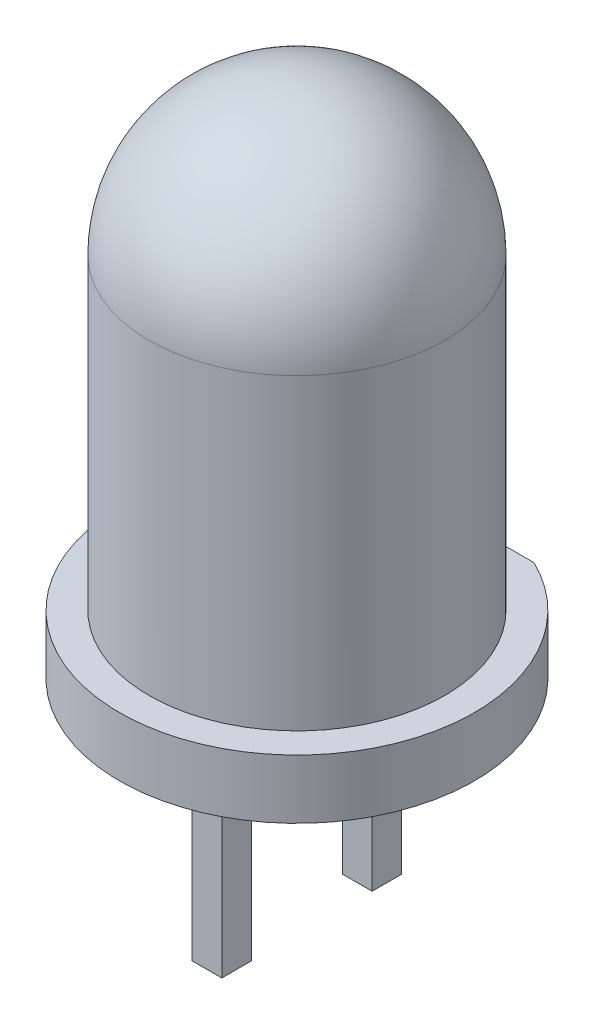
ISO-10303-21;
HEADER;
FILE_DESCRIPTION(('STEP AP214'),'2;1');
FILE_NAME('part.step','',(''),(''),'','','');
FILE_SCHEMA(('AUTOMOTIVE_DESIGN { 1 0 10303 214 1 1 1 1 }'));
ENDSEC;
DATA;
#1=APPLICATION_CONTEXT('core data for automotive mechanical design processes');
#2=APPLICATION_PROTOCOL_DEFINITION('international standard','automotive_design',2000,#1);
#3=PRODUCT_CONTEXT('',#1,'mechanical');
#4=PRODUCT('Part','Part','',(#3));
#5=PRODUCT_RELATED_PRODUCT_CATEGORY('part','',(#4));
#6=PRODUCT_DEFINITION_FORMATION('','',#4);
#7=PRODUCT_DEFINITION_CONTEXT('part definition',#1,'design');
#8=PRODUCT_DEFINITION('design','',#6,#7);
#9=PRODUCT_DEFINITION_SHAPE('','',#8);
#10=(LENGTH_UNIT() NAMED_UNIT(*) SI_UNIT(.MILLI.,.METRE.));
#11=(NAMED_UNIT(*) PLANE_ANGLE_UNIT() SI_UNIT($,.RADIAN.));
#12=(NAMED_UNIT(*) SI_UNIT($,.STERADIAN.) SOLID_ANGLE_UNIT());
#13=UNCERTAINTY_MEASURE_WITH_UNIT(LENGTH_MEASURE(1.E-05),#10,'distance_accuracy_value','');
#14=(GEOMETRIC_REPRESENTATION_CONTEXT(3) GLOBAL_UNCERTAINTY_ASSIGNED_CONTEXT((#13)) GLOBAL_UNIT_ASSIGNED_CONTEXT((#10,
#11,#12)) REPRESENTATION_CONTEXT('',''));
#15=CARTESIAN_POINT('',(0.,0.,0.));
#16=DIRECTION('',(0.,0.,1.));
#17=DIRECTION('',(1.,0.,0.));
#18=AXIS2_PLACEMENT_3D('',#15,#16,#17);
#19=CARTESIAN_POINT('',(4.40526328176769,2.95203620370635,9.18065991280056));
#20=DIRECTION('',(0.,1.,0.));
#21=DIRECTION('',(0.,0.,1.));
#22=AXIS2_PLACEMENT_3D('',#19,#20,#21);
#23=PLANE('',#22);
#24=CARTESIAN_POINT('',(4.40526328176769,2.95203620370635,9.18065991280056));
#25=DIRECTION('',(0.,-1.,0.));
#26=DIRECTION('',(0.,0.,-1.));
#27=AXIS2_PLACEMENT_3D('',#24,#25,#26);
#28=CIRCLE('',#27,3.);
#29=CARTESIAN_POINT('',(5.71293296482989,2.95203620370635,6.48065991280056));
#30=VERTEX_POINT('',#29);
#31=CARTESIAN_POINT('',(3.09759359870549,2.95203620370635,6.48065991280056));
#32=VERTEX_POINT('',#31);
#33=EDGE_CURVE('P0_E53',#30,#32,#28,.T.);
#34=ORIENTED_EDGE('',*,*,#33,.T.);
#35=DIRECTION('',(1.,0.,0.));
#36=VECTOR('',#35,1.);
#37=CARTESIAN_POINT('',(-2.59473671823231,2.95203620370635,6.48065991280056));
#38=LINE('',#37,#36);
#39=EDGE_CURVE('P0_E40',#32,#30,#38,.T.);
#40=ORIENTED_EDGE('',*,*,#39,.T.);
#41=EDGE_LOOP('',(#34,#40));
#42=FACE_BOUND('',#41,.T.);
#43=ADVANCED_FACE('P0_F17',(#42),#23,.F.);
#44=CARTESIAN_POINT('',(4.40526328176769,9.15203620370635,9.18065991280056));
#45=DIRECTION('',(0.,-1.,0.));
#46=DIRECTION('',(-1.,0.,0.));
#47=AXIS2_PLACEMENT_3D('',#44,#45,#46);
#48=SPHERICAL_SURFACE('',#47,2.5);
#49=CARTESIAN_POINT('',(4.40526328176769,9.15203620370635,9.18065991280056));
#50=DIRECTION('',(0.,-1.,0.));
#51=DIRECTION('',(0.,0.,-1.));
#52=AXIS2_PLACEMENT_3D('',#49,#50,#51);
#53=CIRCLE('',#52,2.5);
#54=CARTESIAN_POINT('',(4.40526328176769,9.15203620370635,6.68065991280056));
#55=VERTEX_POINT('',#54);
#56=EDGE_CURVE('P0_E56',#55,#55,#53,.T.);
#57=ORIENTED_EDGE('',*,*,#56,.F.);
#58=EDGE_LOOP('',(#57));
#59=FACE_BOUND('',#58,.T.);
#60=ADVANCED_FACE('P0_F66',(#59),#48,.T.);
#61=CARTESIAN_POINT('',(4.40526328176769,2.95203620370635,9.18065991280056));
#62=DIRECTION('',(0.,-1.,0.));
#63=DIRECTION('',(0.,0.,-1.));
#64=AXIS2_PLACEMENT_3D('',#61,#62,#63);
#65=CYLINDRICAL_SURFACE('',#64,2.5);
#66=ORIENTED_EDGE('',*,*,#56,.T.);
#67=EDGE_LOOP('',(#66));
#68=FACE_BOUND('',#67,.T.);
#69=CARTESIAN_POINT('',(4.40526328176769,3.95203620370635,9.18065991280056));
#70=DIRECTION('',(0.,-1.,0.));
#71=DIRECTION('',(0.,0.,-1.));
#72=AXIS2_PLACEMENT_3D('',#69,#70,#71);
#73=CIRCLE('',#72,2.5);
#74=CARTESIAN_POINT('',(4.40526328176769,3.95203620370635,6.68065991280056));
#75=VERTEX_POINT('',#74);
#76=EDGE_CURVE('P0_E52',#75,#75,#73,.T.);
#77=ORIENTED_EDGE('',*,*,#76,.F.);
#78=EDGE_LOOP('',(#77));
#79=FACE_BOUND('',#78,.T.);
#80=ADVANCED_FACE('P0_F63',(#68,#79),#65,.T.);
#81=CARTESIAN_POINT('',(4.40526328176769,3.95203620370635,9.18065991280056));
#82=DIRECTION('',(0.,1.,0.));
#83=DIRECTION('',(0.,0.,1.));
#84=AXIS2_PLACEMENT_3D('',#81,#82,#83);
#85=PLANE('',#84);
#86=DIRECTION('',(1.,0.,0.));
#87=VECTOR('',#86,1.);
#88=CARTESIAN_POINT('',(-2.59473671823231,3.95203620370635,6.48065991280056));
#89=LINE('',#88,#87);
#90=CARTESIAN_POINT('',(3.09759359870549,3.95203620370635,6.48065991280056));
#91=VERTEX_POINT('',#90);
#92=CARTESIAN_POINT('',(5.71293296482989,3.95203620370635,6.48065991280056));
#93=VERTEX_POINT('',#92);
#94=EDGE_CURVE('P0_E31',#91,#93,#89,.T.);
#95=ORIENTED_EDGE('',*,*,#94,.F.);
#96=CARTESIAN_POINT('',(4.40526328176769,3.95203620370635,9.18065991280056));
#97=DIRECTION('',(0.,-1.,0.));
#98=DIRECTION('',(0.,0.,-1.));
#99=AXIS2_PLACEMENT_3D('',#96,#97,#98);
#100=CIRCLE('',#99,3.);
#101=EDGE_CURVE('P0_E49',#93,#91,#100,.T.);
#102=ORIENTED_EDGE('',*,*,#101,.F.);
#103=EDGE_LOOP('',(#95,#102));
#104=FACE_BOUND('',#103,.T.);
#105=ORIENTED_EDGE('',*,*,#76,.T.);
#106=EDGE_LOOP('',(#105));
#107=FACE_BOUND('',#106,.T.);
#108=ADVANCED_FACE('P0_F47',(#104,#107),#85,.T.);
#109=CARTESIAN_POINT('',(4.40526328176769,2.95203620370635,9.18065991280056));
#110=DIRECTION('',(0.,-1.,0.));
#111=DIRECTION('',(0.,0.,-1.));
#112=AXIS2_PLACEMENT_3D('',#109,#110,#111);
#113=CYLINDRICAL_SURFACE('',#112,3.);
#114=ORIENTED_EDGE('',*,*,#101,.T.);
#115=DIRECTION('',(0.,-1.,0.));
#116=VECTOR('',#115,1.);
#117=CARTESIAN_POINT('',(3.09759359870549,2.95203620370635,6.48065991280056));
#118=LINE('',#117,#116);
#119=EDGE_CURVE('P0_E11',#91,#32,#118,.T.);
#120=ORIENTED_EDGE('',*,*,#119,.T.);
#121=ORIENTED_EDGE('',*,*,#33,.F.);
#122=DIRECTION('',(0.,-1.,0.));
#123=VECTOR('',#122,1.);
#124=CARTESIAN_POINT('',(5.71293296482989,2.95203620370635,6.48065991280056));
#125=LINE('',#124,#123);
#126=EDGE_CURVE('P0_E24',#30,#93,#125,.F.);
#127=ORIENTED_EDGE('',*,*,#126,.T.);
#128=EDGE_LOOP('',(#114,#120,#121,#127));
#129=FACE_BOUND('',#128,.T.);
#130=ADVANCED_FACE('P0_F51',(#129),#113,.T.);
#131=CARTESIAN_POINT('',(-2.59473671823231,3.95203620370635,6.48065991280056));
#132=DIRECTION('',(0.,0.,1.));
#133=DIRECTION('',(1.,0.,0.));
#134=AXIS2_PLACEMENT_3D('',#131,#132,#133);
#135=PLANE('',#134);
#136=ORIENTED_EDGE('',*,*,#94,.T.);
#137=ORIENTED_EDGE('',*,*,#126,.F.);
#138=ORIENTED_EDGE('',*,*,#39,.F.);
#139=ORIENTED_EDGE('',*,*,#119,.F.);
#140=EDGE_LOOP('',(#136,#137,#138,#139));
#141=FACE_BOUND('',#140,.T.);
#142=ADVANCED_FACE('P0_F39',(#141),#135,.F.);
#143=CLOSED_SHELL('',(#43,#60,#80,#108,#130,#142));
#144=MANIFOLD_SOLID_BREP('P0_B1',#143);
#145=CARTESIAN_POINT('',(4.15526328176769,4.95203620370635,9.70065991280056));
#146=DIRECTION('',(0.,-0.707106781186547,0.707106781186548));
#147=DIRECTION('',(0.,0.707106781186548,0.707106781186547));
#148=AXIS2_PLACEMENT_3D('',#145,#146,#147);
#149=PLANE('',#148);
#150=DIRECTION('',(0.,-0.707106781186548,-0.707106781186547));
#151=VECTOR('',#150,1.);
#152=CARTESIAN_POINT('',(4.65526328176769,4.95203620370635,9.70065991280056));
#153=LINE('',#152,#151);
#154=CARTESIAN_POINT('',(4.65526328176769,5.45203620370635,10.2006599128006));
#155=VERTEX_POINT('',#154);
#156=CARTESIAN_POINT('',(4.65526328176769,4.95203620370635,9.70065991280056));
#157=VERTEX_POINT('',#156);
#158=EDGE_CURVE('P1_E100',#155,#157,#153,.T.);
#159=ORIENTED_EDGE('',*,*,#158,.T.);
#160=DIRECTION('',(1.,0.,0.));
#161=VECTOR('',#160,1.);
#162=CARTESIAN_POINT('',(4.15526328176769,4.95203620370635,9.70065991280056));
#163=LINE('',#162,#161);
#164=CARTESIAN_POINT('',(4.15526328176769,4.95203620370635,9.70065991280056));
#165=VERTEX_POINT('',#164);
#166=EDGE_CURVE('P1_E10',#165,#157,#163,.T.);
#167=ORIENTED_EDGE('',*,*,#166,.F.);
#168=DIRECTION('',(0.,-0.707106781186548,-0.707106781186547));
#169=VECTOR('',#168,1.);
#170=CARTESIAN_POINT('',(4.15526328176769,4.95203620370635,9.70065991280056));
#171=LINE('',#170,#169);
#172=CARTESIAN_POINT('',(4.15526328176769,5.45203620370635,10.2006599128006));
#173=VERTEX_POINT('',#172);
#174=EDGE_CURVE('P1_E110',#173,#165,#171,.T.);
#175=ORIENTED_EDGE('',*,*,#174,.F.);
#176=DIRECTION('',(1.,0.,0.));
#177=VECTOR('',#176,1.);
#178=CARTESIAN_POINT('',(4.15526328176769,5.45203620370635,10.2006599128006));
#179=LINE('',#178,#177);
#180=EDGE_CURVE('P1_E96',#173,#155,#179,.T.);
#181=ORIENTED_EDGE('',*,*,#180,.T.);
#182=EDGE_LOOP('',(#159,#167,#175,#181));
#183=FACE_BOUND('',#182,.T.);
#184=ADVANCED_FACE('P1_F16',(#183),#149,.F.);
#185=CARTESIAN_POINT('',(4.15526328176769,4.95203620370635,10.2006599128006));
#186=DIRECTION('',(0.,1.,0.));
#187=DIRECTION('',(-1.,0.,0.));
#188=AXIS2_PLACEMENT_3D('',#185,#186,#187);
#189=PLANE('',#188);
#190=DIRECTION('',(0.,0.,1.));
#191=VECTOR('',#190,1.);
#192=CARTESIAN_POINT('',(4.65526328176769,4.95203620370635,10.2006599128006));
#193=LINE('',#192,#191);
#194=CARTESIAN_POINT('',(4.65526328176769,4.95203620370635,10.2006599128006));
#195=VERTEX_POINT('',#194);
#196=EDGE_CURVE('P1_E103',#157,#195,#193,.T.);
#197=ORIENTED_EDGE('',*,*,#196,.T.);
#198=DIRECTION('',(1.,0.,0.));
#199=VECTOR('',#198,1.);
#200=CARTESIAN_POINT('',(4.15526328176769,4.95203620370635,10.2006599128006));
#201=LINE('',#200,#199);
#202=CARTESIAN_POINT('',(4.15526328176769,4.95203620370635,10.2006599128006));
#203=VERTEX_POINT('',#202);
#204=EDGE_CURVE('P1_E24',#203,#195,#201,.T.);
#205=ORIENTED_EDGE('',*,*,#204,.F.);
#206=DIRECTION('',(0.,0.,1.));
#207=VECTOR('',#206,1.);
#208=CARTESIAN_POINT('',(4.15526328176769,4.95203620370635,10.2006599128006));
#209=LINE('',#208,#207);
#210=EDGE_CURVE('P1_E69',#165,#203,#209,.T.);
#211=ORIENTED_EDGE('',*,*,#210,.F.);
#212=ORIENTED_EDGE('',*,*,#166,.T.);
#213=EDGE_LOOP('',(#197,#205,#211,#212));
#214=FACE_BOUND('',#213,.T.);
#215=ADVANCED_FACE('P1_F135',(#214),#189,.F.);
#216=CARTESIAN_POINT('',(4.15526328176768,-0.547963796293653,10.2006599128006));
#217=DIRECTION('',(0.,0.,1.));
#218=DIRECTION('',(1.,0.,0.));
#219=AXIS2_PLACEMENT_3D('',#216,#217,#218);
#220=PLANE('',#219);
#221=DIRECTION('',(0.,-1.,0.));
#222=VECTOR('',#221,1.);
#223=CARTESIAN_POINT('',(4.65526328176768,-0.547963796293653,10.2006599128006));
#224=LINE('',#223,#222);
#225=CARTESIAN_POINT('',(4.65526328176768,-0.547963796293653,10.2006599128006));
#226=VERTEX_POINT('',#225);
#227=EDGE_CURVE('P1_E105',#195,#226,#224,.T.);
#228=ORIENTED_EDGE('',*,*,#227,.T.);
#229=DIRECTION('',(1.,0.,0.));
#230=VECTOR('',#229,1.);
#231=CARTESIAN_POINT('',(4.15526328176768,-0.547963796293653,10.2006599128006));
#232=LINE('',#231,#230);
#233=CARTESIAN_POINT('',(4.15526328176768,-0.547963796293653,10.2006599128006));
#234=VERTEX_POINT('',#233);
#235=EDGE_CURVE('P1_E91',#234,#226,#232,.T.);
#236=ORIENTED_EDGE('',*,*,#235,.F.);
#237=DIRECTION('',(0.,-1.,0.));
#238=VECTOR('',#237,1.);
#239=CARTESIAN_POINT('',(4.15526328176768,-0.547963796293653,10.2006599128006));
#240=LINE('',#239,#238);
#241=EDGE_CURVE('P1_E82',#203,#234,#240,.T.);
#242=ORIENTED_EDGE('',*,*,#241,.F.);
#243=ORIENTED_EDGE('',*,*,#204,.T.);
#244=EDGE_LOOP('',(#228,#236,#242,#243));
#245=FACE_BOUND('',#244,.T.);
#246=ADVANCED_FACE('P1_F116',(#245),#220,.F.);
#247=CARTESIAN_POINT('',(4.15526328176768,-0.547963796293652,10.7006599128006));
#248=DIRECTION('',(0.,1.,0.));
#249=DIRECTION('',(0.,0.,-1.));
#250=AXIS2_PLACEMENT_3D('',#247,#248,#249);
#251=PLANE('',#250);
#252=DIRECTION('',(0.,0.,1.));
#253=VECTOR('',#252,1.);
#254=CARTESIAN_POINT('',(4.65526328176768,-0.547963796293653,10.7006599128006));
#255=LINE('',#254,#253);
#256=CARTESIAN_POINT('',(4.65526328176768,-0.547963796293653,10.7006599128006));
#257=VERTEX_POINT('',#256);
#258=EDGE_CURVE('P1_E90',#226,#257,#255,.T.);
#259=ORIENTED_EDGE('',*,*,#258,.T.);
#260=DIRECTION('',(1.,0.,0.));
#261=VECTOR('',#260,1.);
#262=CARTESIAN_POINT('',(4.15526328176768,-0.547963796293652,10.7006599128006));
#263=LINE('',#262,#261);
#264=CARTESIAN_POINT('',(4.15526328176768,-0.547963796293652,10.7006599128006));
#265=VERTEX_POINT('',#264);
#266=EDGE_CURVE('P1_E87',#265,#257,#263,.T.);
#267=ORIENTED_EDGE('',*,*,#266,.F.);
#268=DIRECTION('',(0.,0.,1.));
#269=VECTOR('',#268,1.);
#270=CARTESIAN_POINT('',(4.15526328176768,-0.547963796293652,10.7006599128006));
#271=LINE('',#270,#269);
#272=EDGE_CURVE('P1_E76',#234,#265,#271,.T.);
#273=ORIENTED_EDGE('',*,*,#272,.F.);
#274=ORIENTED_EDGE('',*,*,#235,.T.);
#275=EDGE_LOOP('',(#259,#267,#273,#274));
#276=FACE_BOUND('',#275,.T.);
#277=ADVANCED_FACE('P1_F88',(#276),#251,.F.);
#278=CARTESIAN_POINT('',(4.15526328176769,5.45203620370635,10.7006599128006));
#279=DIRECTION('',(0.,0.,-1.));
#280=DIRECTION('',(0.,-1.,0.));
#281=AXIS2_PLACEMENT_3D('',#278,#279,#280);
#282=PLANE('',#281);
#283=DIRECTION('',(0.,1.,0.));
#284=VECTOR('',#283,1.);
#285=CARTESIAN_POINT('',(4.65526328176769,5.45203620370635,10.7006599128006));
#286=LINE('',#285,#284);
#287=CARTESIAN_POINT('',(4.65526328176769,5.45203620370635,10.7006599128006));
#288=VERTEX_POINT('',#287);
#289=EDGE_CURVE('P1_E55',#257,#288,#286,.T.);
#290=ORIENTED_EDGE('',*,*,#289,.T.);
#291=DIRECTION('',(1.,0.,0.));
#292=VECTOR('',#291,1.);
#293=CARTESIAN_POINT('',(4.15526328176769,5.45203620370635,10.7006599128006));
#294=LINE('',#293,#292);
#295=CARTESIAN_POINT('',(4.15526328176769,5.45203620370635,10.7006599128006));
#296=VERTEX_POINT('',#295);
#297=EDGE_CURVE('P1_E92',#296,#288,#294,.T.);
#298=ORIENTED_EDGE('',*,*,#297,.F.);
#299=DIRECTION('',(0.,1.,0.));
#300=VECTOR('',#299,1.);
#301=CARTESIAN_POINT('',(4.15526328176769,5.45203620370635,10.7006599128006));
#302=LINE('',#301,#300);
#303=EDGE_CURVE('P1_E80',#265,#296,#302,.T.);
#304=ORIENTED_EDGE('',*,*,#303,.F.);
#305=ORIENTED_EDGE('',*,*,#266,.T.);
#306=EDGE_LOOP('',(#290,#298,#304,#305));
#307=FACE_BOUND('',#306,.T.);
#308=ADVANCED_FACE('P1_F94',(#307),#282,.F.);
#309=CARTESIAN_POINT('',(4.15526328176769,5.45203620370635,10.2006599128006));
#310=DIRECTION('',(0.,-1.,0.));
#311=DIRECTION('',(0.,0.,1.));
#312=AXIS2_PLACEMENT_3D('',#309,#310,#311);
#313=PLANE('',#312);
#314=DIRECTION('',(0.,0.,-1.));
#315=VECTOR('',#314,1.);
#316=CARTESIAN_POINT('',(4.65526328176769,5.45203620370635,10.2006599128006));
#317=LINE('',#316,#315);
#318=EDGE_CURVE('P1_E61',#288,#155,#317,.T.);
#319=ORIENTED_EDGE('',*,*,#318,.T.);
#320=ORIENTED_EDGE('',*,*,#180,.F.);
#321=DIRECTION('',(0.,0.,-1.));
#322=VECTOR('',#321,1.);
#323=CARTESIAN_POINT('',(4.15526328176769,5.45203620370635,10.2006599128006));
#324=LINE('',#323,#322);
#325=EDGE_CURVE('P1_E32',#296,#173,#324,.T.);
#326=ORIENTED_EDGE('',*,*,#325,.F.);
#327=ORIENTED_EDGE('',*,*,#297,.T.);
#328=EDGE_LOOP('',(#319,#320,#326,#327));
#329=FACE_BOUND('',#328,.T.);
#330=ADVANCED_FACE('P1_F123',(#329),#313,.F.);
#331=CARTESIAN_POINT('',(4.15526328176768,-0.547963796293655,7.66065991280057));
#332=DIRECTION('',(1.,0.,0.));
#333=DIRECTION('',(0.,0.,-1.));
#334=AXIS2_PLACEMENT_3D('',#331,#332,#333);
#335=PLANE('',#334);
#336=ORIENTED_EDGE('',*,*,#174,.T.);
#337=ORIENTED_EDGE('',*,*,#210,.T.);
#338=ORIENTED_EDGE('',*,*,#241,.T.);
#339=ORIENTED_EDGE('',*,*,#272,.T.);
#340=ORIENTED_EDGE('',*,*,#303,.T.);
#341=ORIENTED_EDGE('',*,*,#325,.T.);
#342=EDGE_LOOP('',(#336,#337,#338,#339,#340,#341));
#343=FACE_BOUND('',#342,.T.);
#344=ADVANCED_FACE('P1_F78',(#343),#335,.F.);
#345=CARTESIAN_POINT('',(4.65526328176768,-0.547963796293656,7.66065991280057));
#346=DIRECTION('',(1.,0.,0.));
#347=DIRECTION('',(0.,0.,-1.));
#348=AXIS2_PLACEMENT_3D('',#345,#346,#347);
#349=PLANE('',#348);
#350=ORIENTED_EDGE('',*,*,#158,.F.);
#351=ORIENTED_EDGE('',*,*,#318,.F.);
#352=ORIENTED_EDGE('',*,*,#289,.F.);
#353=ORIENTED_EDGE('',*,*,#258,.F.);
#354=ORIENTED_EDGE('',*,*,#227,.F.);
#355=ORIENTED_EDGE('',*,*,#196,.F.);
#356=EDGE_LOOP('',(#350,#351,#352,#353,#354,#355));
#357=FACE_BOUND('',#356,.T.);
#358=ADVANCED_FACE('P1_F119',(#357),#349,.T.);
#359=CLOSED_SHELL('',(#184,#215,#246,#277,#308,#330,#344,#358));
#360=MANIFOLD_SOLID_BREP('P1_B1',#359);
#361=CARTESIAN_POINT('',(4.15526328176769,5.45203620370635,7.66065991280056));
#362=DIRECTION('',(0.,-1.,0.));
#363=DIRECTION('',(0.,0.,1.));
#364=AXIS2_PLACEMENT_3D('',#361,#362,#363);
#365=PLANE('',#364);
#366=DIRECTION('',(0.,0.,-1.));
#367=VECTOR('',#366,1.);
#368=CARTESIAN_POINT('',(4.65526328176769,5.45203620370634,7.66065991280056));
#369=LINE('',#368,#367);
#370=CARTESIAN_POINT('',(4.65526328176769,5.45203620370635,9.70065991280056));
#371=VERTEX_POINT('',#370);
#372=CARTESIAN_POINT('',(4.65526328176769,5.45203620370634,7.66065991280056));
#373=VERTEX_POINT('',#372);
#374=EDGE_CURVE('P2_E101',#371,#373,#369,.T.);
#375=ORIENTED_EDGE('',*,*,#374,.T.);
#376=DIRECTION('',(1.,0.,0.));
#377=VECTOR('',#376,1.);
#378=CARTESIAN_POINT('',(4.15526328176769,5.45203620370635,7.66065991280056));
#379=LINE('',#378,#377);
#380=CARTESIAN_POINT('',(4.15526328176769,5.45203620370635,7.66065991280056));
#381=VERTEX_POINT('',#380);
#382=EDGE_CURVE('P2_E11',#381,#373,#379,.T.);
#383=ORIENTED_EDGE('',*,*,#382,.F.);
#384=DIRECTION('',(0.,0.,-1.));
#385=VECTOR('',#384,1.);
#386=CARTESIAN_POINT('',(4.15526328176769,5.45203620370635,7.66065991280056));
#387=LINE('',#386,#385);
#388=CARTESIAN_POINT('',(4.15526328176769,5.45203620370635,9.70065991280056));
#389=VERTEX_POINT('',#388);
#390=EDGE_CURVE('P2_E111',#389,#381,#387,.T.);
#391=ORIENTED_EDGE('',*,*,#390,.F.);
#392=DIRECTION('',(1.,0.,0.));
#393=VECTOR('',#392,1.);
#394=CARTESIAN_POINT('',(4.15526328176769,5.45203620370635,9.70065991280056));
#395=LINE('',#394,#393);
#396=EDGE_CURVE('P2_E97',#389,#371,#395,.T.);
#397=ORIENTED_EDGE('',*,*,#396,.T.);
#398=EDGE_LOOP('',(#375,#383,#391,#397));
#399=FACE_BOUND('',#398,.T.);
#400=ADVANCED_FACE('P2_F17',(#399),#365,.F.);
#401=CARTESIAN_POINT('',(4.15526328176769,5.45203620370635,7.66065991280056));
#402=DIRECTION('',(0.,0.,1.));
#403=DIRECTION('',(0.,1.,0.));
#404=AXIS2_PLACEMENT_3D('',#401,#402,#403);
#405=PLANE('',#404);
#406=DIRECTION('',(0.,-1.,0.));
#407=VECTOR('',#406,1.);
#408=CARTESIAN_POINT('',(4.65526328176769,5.45203620370634,7.66065991280056));
#409=LINE('',#408,#407);
#410=CARTESIAN_POINT('',(4.65526328176768,-0.547963796293656,7.66065991280057));
#411=VERTEX_POINT('',#410);
#412=EDGE_CURVE('P2_E104',#373,#411,#409,.T.);
#413=ORIENTED_EDGE('',*,*,#412,.T.);
#414=DIRECTION('',(1.,0.,0.));
#415=VECTOR('',#414,1.);
#416=CARTESIAN_POINT('',(4.15526328176768,-0.547963796293655,7.66065991280057));
#417=LINE('',#416,#415);
#418=CARTESIAN_POINT('',(4.15526328176768,-0.547963796293655,7.66065991280057));
#419=VERTEX_POINT('',#418);
#420=EDGE_CURVE('P2_E25',#419,#411,#417,.T.);
#421=ORIENTED_EDGE('',*,*,#420,.F.);
#422=DIRECTION('',(0.,-1.,0.));
#423=VECTOR('',#422,1.);
#424=CARTESIAN_POINT('',(4.15526328176769,5.45203620370635,7.66065991280056));
#425=LINE('',#424,#423);
#426=EDGE_CURVE('P2_E70',#381,#419,#425,.T.);
#427=ORIENTED_EDGE('',*,*,#426,.F.);
#428=ORIENTED_EDGE('',*,*,#382,.T.);
#429=EDGE_LOOP('',(#413,#421,#427,#428));
#430=FACE_BOUND('',#429,.T.);
#431=ADVANCED_FACE('P2_F136',(#430),#405,.F.);
#432=CARTESIAN_POINT('',(4.15526328176768,-0.547963796293655,8.16065991280057));
#433=DIRECTION('',(0.,1.,0.));
#434=DIRECTION('',(0.,0.,-1.));
#435=AXIS2_PLACEMENT_3D('',#432,#433,#434);
#436=PLANE('',#435);
#437=DIRECTION('',(0.,0.,1.));
#438=VECTOR('',#437,1.);
#439=CARTESIAN_POINT('',(4.65526328176768,-0.547963796293655,8.16065991280057));
#440=LINE('',#439,#438);
#441=CARTESIAN_POINT('',(4.65526328176768,-0.547963796293655,8.16065991280057));
#442=VERTEX_POINT('',#441);
#443=EDGE_CURVE('P2_E106',#411,#442,#440,.T.);
#444=ORIENTED_EDGE('',*,*,#443,.T.);
#445=DIRECTION('',(1.,0.,0.));
#446=VECTOR('',#445,1.);
#447=CARTESIAN_POINT('',(4.15526328176768,-0.547963796293655,8.16065991280057));
#448=LINE('',#447,#446);
#449=CARTESIAN_POINT('',(4.15526328176768,-0.547963796293655,8.16065991280057));
#450=VERTEX_POINT('',#449);
#451=EDGE_CURVE('P2_E92',#450,#442,#448,.T.);
#452=ORIENTED_EDGE('',*,*,#451,.F.);
#453=DIRECTION('',(0.,0.,1.));
#454=VECTOR('',#453,1.);
#455=CARTESIAN_POINT('',(4.15526328176768,-0.547963796293655,8.16065991280057));
#456=LINE('',#455,#454);
#457=EDGE_CURVE('P2_E83',#419,#450,#456,.T.);
#458=ORIENTED_EDGE('',*,*,#457,.F.);
#459=ORIENTED_EDGE('',*,*,#420,.T.);
#460=EDGE_LOOP('',(#444,#452,#458,#459));
#461=FACE_BOUND('',#460,.T.);
#462=ADVANCED_FACE('P2_F117',(#461),#436,.F.);
#463=CARTESIAN_POINT('',(4.15526328176769,4.95203620370634,8.16065991280056));
#464=DIRECTION('',(0.,0.,-1.));
#465=DIRECTION('',(0.,-1.,0.));
#466=AXIS2_PLACEMENT_3D('',#463,#464,#465);
#467=PLANE('',#466);
#468=DIRECTION('',(0.,1.,0.));
#469=VECTOR('',#468,1.);
#470=CARTESIAN_POINT('',(4.65526328176769,4.95203620370634,8.16065991280056));
#471=LINE('',#470,#469);
#472=CARTESIAN_POINT('',(4.65526328176769,4.95203620370634,8.16065991280056));
#473=VERTEX_POINT('',#472);
#474=EDGE_CURVE('P2_E91',#442,#473,#471,.T.);
#475=ORIENTED_EDGE('',*,*,#474,.T.);
#476=DIRECTION('',(1.,0.,0.));
#477=VECTOR('',#476,1.);
#478=CARTESIAN_POINT('',(4.15526328176769,4.95203620370634,8.16065991280056));
#479=LINE('',#478,#477);
#480=CARTESIAN_POINT('',(4.15526328176769,4.95203620370634,8.16065991280056));
#481=VERTEX_POINT('',#480);
#482=EDGE_CURVE('P2_E88',#481,#473,#479,.T.);
#483=ORIENTED_EDGE('',*,*,#482,.F.);
#484=DIRECTION('',(0.,1.,0.));
#485=VECTOR('',#484,1.);
#486=CARTESIAN_POINT('',(4.15526328176769,4.95203620370634,8.16065991280056));
#487=LINE('',#486,#485);
#488=EDGE_CURVE('P2_E77',#450,#481,#487,.T.);
#489=ORIENTED_EDGE('',*,*,#488,.F.);
#490=ORIENTED_EDGE('',*,*,#451,.T.);
#491=EDGE_LOOP('',(#475,#483,#489,#490));
#492=FACE_BOUND('',#491,.T.);
#493=ADVANCED_FACE('P2_F89',(#492),#467,.F.);
#494=CARTESIAN_POINT('',(4.15526328176769,4.95203620370635,9.20065991280057));
#495=DIRECTION('',(0.,1.,0.));
#496=DIRECTION('',(0.,0.,-1.));
#497=AXIS2_PLACEMENT_3D('',#494,#495,#496);
#498=PLANE('',#497);
#499=DIRECTION('',(0.,0.,1.));
#500=VECTOR('',#499,1.);
#501=CARTESIAN_POINT('',(4.65526328176769,4.95203620370635,9.20065991280057));
#502=LINE('',#501,#500);
#503=CARTESIAN_POINT('',(4.65526328176769,4.95203620370635,9.20065991280057));
#504=VERTEX_POINT('',#503);
#505=EDGE_CURVE('P2_E56',#473,#504,#502,.T.);
#506=ORIENTED_EDGE('',*,*,#505,.T.);
#507=DIRECTION('',(1.,0.,0.));
#508=VECTOR('',#507,1.);
#509=CARTESIAN_POINT('',(4.15526328176769,4.95203620370635,9.20065991280057));
#510=LINE('',#509,#508);
#511=CARTESIAN_POINT('',(4.15526328176769,4.95203620370635,9.20065991280057));
#512=VERTEX_POINT('',#511);
#513=EDGE_CURVE('P2_E93',#512,#504,#510,.T.);
#514=ORIENTED_EDGE('',*,*,#513,.F.);
#515=DIRECTION('',(0.,0.,1.));
#516=VECTOR('',#515,1.);
#517=CARTESIAN_POINT('',(4.15526328176769,4.95203620370635,9.20065991280057));
#518=LINE('',#517,#516);
#519=EDGE_CURVE('P2_E81',#481,#512,#518,.T.);
#520=ORIENTED_EDGE('',*,*,#519,.F.);
#521=ORIENTED_EDGE('',*,*,#482,.T.);
#522=EDGE_LOOP('',(#506,#514,#520,#521));
#523=FACE_BOUND('',#522,.T.);
#524=ADVANCED_FACE('P2_F95',(#523),#498,.F.);
#525=CARTESIAN_POINT('',(4.15526328176769,5.45203620370635,9.70065991280056));
#526=DIRECTION('',(0.,0.707106781186547,-0.707106781186548));
#527=DIRECTION('',(0.,-0.707106781186548,-0.707106781186547));
#528=AXIS2_PLACEMENT_3D('',#525,#526,#527);
#529=PLANE('',#528);
#530=DIRECTION('',(0.,0.707106781186548,0.707106781186547));
#531=VECTOR('',#530,1.);
#532=CARTESIAN_POINT('',(4.65526328176769,5.45203620370635,9.70065991280056));
#533=LINE('',#532,#531);
#534=EDGE_CURVE('P2_E62',#504,#371,#533,.T.);
#535=ORIENTED_EDGE('',*,*,#534,.T.);
#536=ORIENTED_EDGE('',*,*,#396,.F.);
#537=DIRECTION('',(0.,0.707106781186548,0.707106781186547));
#538=VECTOR('',#537,1.);
#539=CARTESIAN_POINT('',(4.15526328176769,5.45203620370635,9.70065991280056));
#540=LINE('',#539,#538);
#541=EDGE_CURVE('P2_E33',#512,#389,#540,.T.);
#542=ORIENTED_EDGE('',*,*,#541,.F.);
#543=ORIENTED_EDGE('',*,*,#513,.T.);
#544=EDGE_LOOP('',(#535,#536,#542,#543));
#545=FACE_BOUND('',#544,.T.);
#546=ADVANCED_FACE('P2_F124',(#545),#529,.F.);
#547=CARTESIAN_POINT('',(4.15526328176768,-0.547963796293655,7.66065991280057));
#548=DIRECTION('',(1.,0.,0.));
#549=DIRECTION('',(0.,0.,-1.));
#550=AXIS2_PLACEMENT_3D('',#547,#548,#549);
#551=PLANE('',#550);
#552=ORIENTED_EDGE('',*,*,#390,.T.);
#553=ORIENTED_EDGE('',*,*,#426,.T.);
#554=ORIENTED_EDGE('',*,*,#457,.T.);
#555=ORIENTED_EDGE('',*,*,#488,.T.);
#556=ORIENTED_EDGE('',*,*,#519,.T.);
#557=ORIENTED_EDGE('',*,*,#541,.T.);
#558=EDGE_LOOP('',(#552,#553,#554,#555,#556,#557));
#559=FACE_BOUND('',#558,.T.);
#560=ADVANCED_FACE('P2_F79',(#559),#551,.F.);
#561=CARTESIAN_POINT('',(4.65526328176768,-0.547963796293656,7.66065991280057));
#562=DIRECTION('',(1.,0.,0.));
#563=DIRECTION('',(0.,0.,-1.));
#564=AXIS2_PLACEMENT_3D('',#561,#562,#563);
#565=PLANE('',#564);
#566=ORIENTED_EDGE('',*,*,#374,.F.);
#567=ORIENTED_EDGE('',*,*,#534,.F.);
#568=ORIENTED_EDGE('',*,*,#505,.F.);
#569=ORIENTED_EDGE('',*,*,#474,.F.);
#570=ORIENTED_EDGE('',*,*,#443,.F.);
#571=ORIENTED_EDGE('',*,*,#412,.F.);
#572=EDGE_LOOP('',(#566,#567,#568,#569,#570,#571));
#573=FACE_BOUND('',#572,.T.);
#574=ADVANCED_FACE('P2_F120',(#573),#565,.T.);
#575=CLOSED_SHELL('',(#400,#431,#462,#493,#524,#546,#560,#574));
#576=MANIFOLD_SOLID_BREP('P2_B1',#575);
#577=ADVANCED_BREP_SHAPE_REPRESENTATION('',(#18,#144,#360,#576),#14);
#578=SHAPE_DEFINITION_REPRESENTATION(#9,#577);
ENDSEC;
END-ISO-10303-21;
